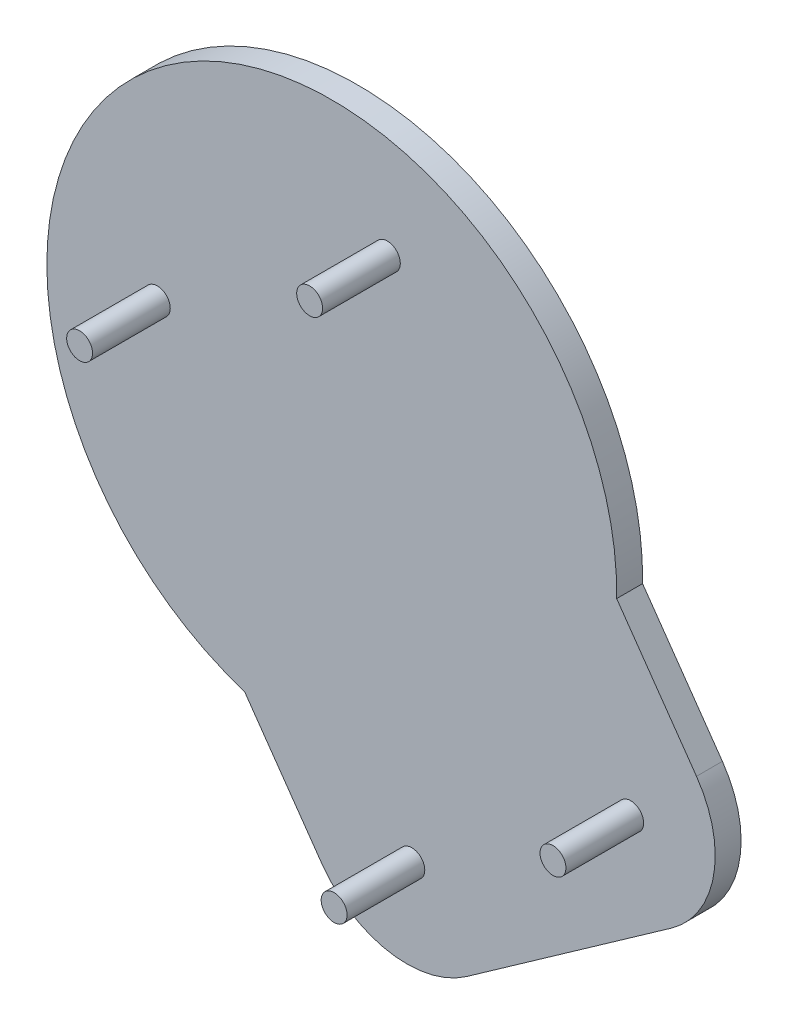
ISO-10303-21;
HEADER;
FILE_DESCRIPTION(('STEP AP214'),'2;1');
FILE_NAME('part.step','',(''),(''),'','','');
FILE_SCHEMA(('AUTOMOTIVE_DESIGN { 1 0 10303 214 1 1 1 1 }'));
ENDSEC;
DATA;
#1=APPLICATION_CONTEXT('core data for automotive mechanical design processes');
#2=APPLICATION_PROTOCOL_DEFINITION('international standard','automotive_design',2000,#1);
#3=PRODUCT_CONTEXT('',#1,'mechanical');
#4=PRODUCT('Part','Part','',(#3));
#5=PRODUCT_RELATED_PRODUCT_CATEGORY('part','',(#4));
#6=PRODUCT_DEFINITION_FORMATION('','',#4);
#7=PRODUCT_DEFINITION_CONTEXT('part definition',#1,'design');
#8=PRODUCT_DEFINITION('design','',#6,#7);
#9=PRODUCT_DEFINITION_SHAPE('','',#8);
#10=(LENGTH_UNIT() NAMED_UNIT(*) SI_UNIT(.MILLI.,.METRE.));
#11=(NAMED_UNIT(*) PLANE_ANGLE_UNIT() SI_UNIT($,.RADIAN.));
#12=(NAMED_UNIT(*) SI_UNIT($,.STERADIAN.) SOLID_ANGLE_UNIT());
#13=UNCERTAINTY_MEASURE_WITH_UNIT(LENGTH_MEASURE(1.E-05),#10,'distance_accuracy_value','');
#14=(GEOMETRIC_REPRESENTATION_CONTEXT(3) GLOBAL_UNCERTAINTY_ASSIGNED_CONTEXT((#13)) GLOBAL_UNIT_ASSIGNED_CONTEXT((#10,
#11,#12)) REPRESENTATION_CONTEXT('',''));
#15=CARTESIAN_POINT('',(0.,0.,0.));
#16=DIRECTION('',(0.,0.,1.));
#17=DIRECTION('',(1.,0.,0.));
#18=AXIS2_PLACEMENT_3D('',#15,#16,#17);
#19=CARTESIAN_POINT('',(-74.5185209199185,51.7749971600267,20.));
#20=DIRECTION('',(0.,0.,-1.));
#21=DIRECTION('',(-1.,0.,0.));
#22=AXIS2_PLACEMENT_3D('',#19,#20,#21);
#23=CYLINDRICAL_SURFACE('',#22,2.50000000000001);
#24=CARTESIAN_POINT('',(-74.5185209199185,51.7749971600267,20.));
#25=DIRECTION('',(0.,0.,1.));
#26=DIRECTION('',(1.,0.,0.));
#27=AXIS2_PLACEMENT_3D('',#24,#25,#26);
#28=CIRCLE('',#27,2.50000000000001);
#29=CARTESIAN_POINT('',(-72.0185209199185,51.7749971600267,20.));
#30=VERTEX_POINT('',#29);
#31=EDGE_CURVE('E55',#30,#30,#28,.T.);
#32=ORIENTED_EDGE('',*,*,#31,.F.);
#33=EDGE_LOOP('',(#32));
#34=FACE_BOUND('',#33,.T.);
#35=CARTESIAN_POINT('',(-74.5185209199185,51.7749971600267,5.));
#36=DIRECTION('',(0.,0.,1.));
#37=DIRECTION('',(1.,0.,0.));
#38=AXIS2_PLACEMENT_3D('',#35,#36,#37);
#39=CIRCLE('',#38,2.50000000000001);
#40=CARTESIAN_POINT('',(-72.0185209199185,51.7749971600267,5.));
#41=VERTEX_POINT('',#40);
#42=EDGE_CURVE('E11',#41,#41,#39,.T.);
#43=ORIENTED_EDGE('',*,*,#42,.T.);
#44=EDGE_LOOP('',(#43));
#45=FACE_BOUND('',#44,.T.);
#46=ADVANCED_FACE('F51',(#34,#45),#23,.T.);
#47=CARTESIAN_POINT('',(-74.5185209199185,51.7749971600267,20.));
#48=DIRECTION('',(0.,0.,1.));
#49=DIRECTION('',(1.,0.,0.));
#50=AXIS2_PLACEMENT_3D('',#47,#48,#49);
#51=PLANE('',#50);
#52=ORIENTED_EDGE('',*,*,#31,.T.);
#53=EDGE_LOOP('',(#52));
#54=FACE_BOUND('',#53,.T.);
#55=ADVANCED_FACE('F53',(#54),#51,.T.);
#56=CARTESIAN_POINT('',(-74.5185209199185,51.7749971600267,5.));
#57=DIRECTION('',(0.,0.,1.));
#58=DIRECTION('',(1.,0.,0.));
#59=AXIS2_PLACEMENT_3D('',#56,#57,#58);
#60=PLANE('',#59);
#61=ORIENTED_EDGE('',*,*,#42,.F.);
#62=EDGE_LOOP('',(#61));
#63=FACE_BOUND('',#62,.T.);
#64=ADVANCED_FACE('F70',(#63),#60,.F.);
#65=CLOSED_SHELL('',(#46,#55,#64));
#66=MANIFOLD_SOLID_BREP('B2',#65);
#67=CARTESIAN_POINT('',(-30.1155396434484,81.4789435820046,20.));
#68=DIRECTION('',(0.,0.,-1.));
#69=DIRECTION('',(-1.,0.,0.));
#70=AXIS2_PLACEMENT_3D('',#67,#68,#69);
#71=CYLINDRICAL_SURFACE('',#70,2.50000000000001);
#72=CARTESIAN_POINT('',(-30.1155396434484,81.4789435820046,20.));
#73=DIRECTION('',(0.,0.,1.));
#74=DIRECTION('',(1.,0.,0.));
#75=AXIS2_PLACEMENT_3D('',#72,#73,#74);
#76=CIRCLE('',#75,2.50000000000001);
#77=CARTESIAN_POINT('',(-27.6155396434484,81.4789435820046,20.));
#78=VERTEX_POINT('',#77);
#79=EDGE_CURVE('E109',#78,#78,#76,.T.);
#80=ORIENTED_EDGE('',*,*,#79,.F.);
#81=EDGE_LOOP('',(#80));
#82=FACE_BOUND('',#81,.T.);
#83=CARTESIAN_POINT('',(-30.1155396434484,81.4789435820046,5.));
#84=DIRECTION('',(0.,0.,1.));
#85=DIRECTION('',(1.,0.,0.));
#86=AXIS2_PLACEMENT_3D('',#83,#84,#85);
#87=CIRCLE('',#86,2.50000000000001);
#88=CARTESIAN_POINT('',(-27.6155396434484,81.4789435820046,5.));
#89=VERTEX_POINT('',#88);
#90=EDGE_CURVE('E50',#89,#89,#87,.T.);
#91=ORIENTED_EDGE('',*,*,#90,.T.);
#92=EDGE_LOOP('',(#91));
#93=FACE_BOUND('',#92,.T.);
#94=ADVANCED_FACE('F105',(#82,#93),#71,.T.);
#95=CARTESIAN_POINT('',(-30.1155396434484,81.4789435820046,20.));
#96=DIRECTION('',(0.,0.,1.));
#97=DIRECTION('',(1.,0.,0.));
#98=AXIS2_PLACEMENT_3D('',#95,#96,#97);
#99=PLANE('',#98);
#100=ORIENTED_EDGE('',*,*,#79,.T.);
#101=EDGE_LOOP('',(#100));
#102=FACE_BOUND('',#101,.T.);
#103=ADVANCED_FACE('F107',(#102),#99,.T.);
#104=CARTESIAN_POINT('',(-30.1155396434484,81.4789435820046,5.));
#105=DIRECTION('',(0.,0.,1.));
#106=DIRECTION('',(1.,0.,0.));
#107=AXIS2_PLACEMENT_3D('',#104,#105,#106);
#108=PLANE('',#107);
#109=ORIENTED_EDGE('',*,*,#90,.F.);
#110=EDGE_LOOP('',(#109));
#111=FACE_BOUND('',#110,.T.);
#112=ADVANCED_FACE('F124',(#111),#108,.F.);
#113=CLOSED_SHELL('',(#94,#103,#112));
#114=MANIFOLD_SOLID_BREP('B6',#113);
#115=CARTESIAN_POINT('',(-25.3905391851779,-17.5834556476924,20.));
#116=DIRECTION('',(0.,0.,-1.));
#117=DIRECTION('',(-1.,0.,0.));
#118=AXIS2_PLACEMENT_3D('',#115,#116,#117);
#119=CYLINDRICAL_SURFACE('',#118,2.5);
#120=CARTESIAN_POINT('',(-25.3905391851779,-17.5834556476924,20.));
#121=DIRECTION('',(0.,0.,1.));
#122=DIRECTION('',(1.,0.,0.));
#123=AXIS2_PLACEMENT_3D('',#120,#121,#122);
#124=CIRCLE('',#123,2.5);
#125=CARTESIAN_POINT('',(-22.8905391851779,-17.5834556476924,20.));
#126=VERTEX_POINT('',#125);
#127=EDGE_CURVE('E163',#126,#126,#124,.T.);
#128=ORIENTED_EDGE('',*,*,#127,.F.);
#129=EDGE_LOOP('',(#128));
#130=FACE_BOUND('',#129,.T.);
#131=CARTESIAN_POINT('',(-25.3905391851779,-17.5834556476924,5.));
#132=DIRECTION('',(0.,0.,1.));
#133=DIRECTION('',(1.,0.,0.));
#134=AXIS2_PLACEMENT_3D('',#131,#132,#133);
#135=CIRCLE('',#134,2.5);
#136=CARTESIAN_POINT('',(-22.8905391851779,-17.5834556476924,5.));
#137=VERTEX_POINT('',#136);
#138=EDGE_CURVE('E104',#137,#137,#135,.T.);
#139=ORIENTED_EDGE('',*,*,#138,.T.);
#140=EDGE_LOOP('',(#139));
#141=FACE_BOUND('',#140,.T.);
#142=ADVANCED_FACE('F159',(#130,#141),#119,.T.);
#143=CARTESIAN_POINT('',(-25.3905391851779,-17.5834556476924,20.));
#144=DIRECTION('',(0.,0.,1.));
#145=DIRECTION('',(1.,0.,0.));
#146=AXIS2_PLACEMENT_3D('',#143,#144,#145);
#147=PLANE('',#146);
#148=ORIENTED_EDGE('',*,*,#127,.T.);
#149=EDGE_LOOP('',(#148));
#150=FACE_BOUND('',#149,.T.);
#151=ADVANCED_FACE('F161',(#150),#147,.T.);
#152=CARTESIAN_POINT('',(-25.3905391851779,-17.5834556476924,5.));
#153=DIRECTION('',(0.,0.,1.));
#154=DIRECTION('',(1.,0.,0.));
#155=AXIS2_PLACEMENT_3D('',#152,#153,#154);
#156=PLANE('',#155);
#157=ORIENTED_EDGE('',*,*,#138,.F.);
#158=EDGE_LOOP('',(#157));
#159=FACE_BOUND('',#158,.T.);
#160=ADVANCED_FACE('F178',(#159),#156,.F.);
#161=CLOSED_SHELL('',(#142,#151,#160));
#162=MANIFOLD_SOLID_BREP('B45',#161);
#163=CARTESIAN_POINT('',(16.857134213477,11.4036523546496,20.));
#164=DIRECTION('',(0.,0.,-1.));
#165=DIRECTION('',(-1.,0.,0.));
#166=AXIS2_PLACEMENT_3D('',#163,#164,#165);
#167=CYLINDRICAL_SURFACE('',#166,2.50000000000001);
#168=CARTESIAN_POINT('',(16.857134213477,11.4036523546496,20.));
#169=DIRECTION('',(0.,0.,1.));
#170=DIRECTION('',(1.,0.,0.));
#171=AXIS2_PLACEMENT_3D('',#168,#169,#170);
#172=CIRCLE('',#171,2.50000000000001);
#173=CARTESIAN_POINT('',(19.357134213477,11.4036523546496,20.));
#174=VERTEX_POINT('',#173);
#175=EDGE_CURVE('E158',#174,#174,#172,.T.);
#176=ORIENTED_EDGE('',*,*,#175,.F.);
#177=EDGE_LOOP('',(#176));
#178=FACE_BOUND('',#177,.T.);
#179=CARTESIAN_POINT('',(16.857134213477,11.4036523546496,5.));
#180=DIRECTION('',(0.,0.,1.));
#181=DIRECTION('',(1.,0.,0.));
#182=AXIS2_PLACEMENT_3D('',#179,#180,#181);
#183=CIRCLE('',#182,2.50000000000001);
#184=CARTESIAN_POINT('',(19.357134213477,11.4036523546496,5.));
#185=VERTEX_POINT('',#184);
#186=EDGE_CURVE('E217',#185,#185,#183,.T.);
#187=ORIENTED_EDGE('',*,*,#186,.T.);
#188=EDGE_LOOP('',(#187));
#189=FACE_BOUND('',#188,.T.);
#190=ADVANCED_FACE('F214',(#178,#189),#167,.T.);
#191=CARTESIAN_POINT('',(16.857134213477,11.4036523546496,20.));
#192=DIRECTION('',(0.,0.,1.));
#193=DIRECTION('',(1.,0.,0.));
#194=AXIS2_PLACEMENT_3D('',#191,#192,#193);
#195=PLANE('',#194);
#196=ORIENTED_EDGE('',*,*,#175,.T.);
#197=EDGE_LOOP('',(#196));
#198=FACE_BOUND('',#197,.T.);
#199=ADVANCED_FACE('F229',(#198),#195,.T.);
#200=CARTESIAN_POINT('',(16.857134213477,11.4036523546496,5.));
#201=DIRECTION('',(0.,0.,1.));
#202=DIRECTION('',(1.,0.,0.));
#203=AXIS2_PLACEMENT_3D('',#200,#201,#202);
#204=PLANE('',#203);
#205=ORIENTED_EDGE('',*,*,#186,.F.);
#206=EDGE_LOOP('',(#205));
#207=FACE_BOUND('',#206,.T.);
#208=ADVANCED_FACE('F227',(#207),#204,.F.);
#209=CLOSED_SHELL('',(#190,#199,#208));
#210=MANIFOLD_SOLID_BREP('B99',#209);
#211=CARTESIAN_POINT('',(-40.8400789490038,47.2312465569129,5.));
#212=DIRECTION('',(0.,0.,1.));
#213=DIRECTION('',(1.,0.,0.));
#214=AXIS2_PLACEMENT_3D('',#211,#212,#213);
#215=PLANE('',#214);
#216=CARTESIAN_POINT('',(-74.5185209199185,51.7749971600267,5.));
#217=DIRECTION('',(0.,0.,1.));
#218=DIRECTION('',(1.,0.,0.));
#219=AXIS2_PLACEMENT_3D('',#216,#217,#218);
#220=CIRCLE('',#219,2.50000000000002);
#221=CARTESIAN_POINT('',(-72.0185209199185,51.7749971600267,5.));
#222=VERTEX_POINT('',#221);
#223=EDGE_CURVE('E433',#222,#222,#220,.T.);
#224=ORIENTED_EDGE('',*,*,#223,.F.);
#225=EDGE_LOOP('',(#224));
#226=FACE_BOUND('',#225,.T.);
#227=CARTESIAN_POINT('',(16.857134213477,11.4036523546496,5.));
#228=DIRECTION('',(0.,0.,1.));
#229=DIRECTION('',(1.,0.,0.));
#230=AXIS2_PLACEMENT_3D('',#227,#228,#229);
#231=CIRCLE('',#230,2.50000000000001);
#232=CARTESIAN_POINT('',(19.357134213477,11.4036523546496,5.));
#233=VERTEX_POINT('',#232);
#234=EDGE_CURVE('E355',#233,#233,#231,.T.);
#235=ORIENTED_EDGE('',*,*,#234,.F.);
#236=EDGE_LOOP('',(#235));
#237=FACE_BOUND('',#236,.T.);
#238=CARTESIAN_POINT('',(-40.8400789490038,47.2312465569129,5.));
#239=DIRECTION('',(0.,0.,1.));
#240=DIRECTION('',(1.,0.,0.));
#241=AXIS2_PLACEMENT_3D('',#238,#239,#240);
#242=CIRCLE('',#241,55.);
#243=CARTESIAN_POINT('',(14.1526546191799,46.3372360990538,5.));
#244=VERTEX_POINT('',#243);
#245=CARTESIAN_POINT('',(-57.6728115875673,-5.12960820997038,5.));
#246=VERTEX_POINT('',#245);
#247=EDGE_CURVE('E367',#244,#246,#242,.T.);
#248=ORIENTED_EDGE('',*,*,#247,.T.);
#249=DIRECTION('',(0.57357643635105,-0.819152044288989,0.));
#250=VECTOR('',#249,1.);
#251=CARTESIAN_POINT('',(-57.6728115875673,-5.12960820997038,5.));
#252=LINE('',#251,#250);
#253=CARTESIAN_POINT('',(-42.7356817571262,-26.4620404037628,5.));
#254=VERTEX_POINT('',#253);
#255=EDGE_CURVE('E315',#246,#254,#252,.T.);
#256=ORIENTED_EDGE('',*,*,#255,.T.);
#257=CARTESIAN_POINT('',(-26.3526408713464,-14.9905116767419,5.));
#258=DIRECTION('',(0.,0.,1.));
#259=DIRECTION('',(1.,0.,0.));
#260=AXIS2_PLACEMENT_3D('',#257,#258,#259);
#261=CIRCLE('',#260,20.);
#262=CARTESIAN_POINT('',(-14.8326585328515,-31.339517974397,5.));
#263=VERTEX_POINT('',#262);
#264=EDGE_CURVE('E328',#254,#263,#261,.T.);
#265=ORIENTED_EDGE('',*,*,#264,.T.);
#266=DIRECTION('',(0.817450314882761,0.575999116924735,0.));
#267=VECTOR('',#266,1.);
#268=CARTESIAN_POINT('',(-14.8326585328515,-31.339517974397,5.));
#269=LINE('',#268,#267);
#270=CARTESIAN_POINT('',(24.6962619923903,-3.48629815051967,5.));
#271=VERTEX_POINT('',#270);
#272=EDGE_CURVE('E322',#263,#271,#269,.T.);
#273=ORIENTED_EDGE('',*,*,#272,.T.);
#274=CARTESIAN_POINT('',(13.1762796538957,12.8627081471356,5.));
#275=DIRECTION('',(0.,0.,1.));
#276=DIRECTION('',(1.,0.,0.));
#277=AXIS2_PLACEMENT_3D('',#274,#275,#276);
#278=CIRCLE('',#277,20.);
#279=CARTESIAN_POINT('',(29.5593205396754,24.3342368741567,5.));
#280=VERTEX_POINT('',#279);
#281=EDGE_CURVE('E326',#271,#280,#278,.T.);
#282=ORIENTED_EDGE('',*,*,#281,.T.);
#283=DIRECTION('',(-0.57357643635105,0.819152044288989,0.));
#284=VECTOR('',#283,1.);
#285=CARTESIAN_POINT('',(29.5593205396754,24.3342368741567,5.));
#286=LINE('',#285,#284);
#287=EDGE_CURVE('E278',#280,#244,#286,.T.);
#288=ORIENTED_EDGE('',*,*,#287,.T.);
#289=EDGE_LOOP('',(#248,#256,#265,#273,#282,#288));
#290=FACE_BOUND('',#289,.T.);
#291=CARTESIAN_POINT('',(-25.3905391851779,-17.5834556476924,5.));
#292=DIRECTION('',(0.,0.,1.));
#293=DIRECTION('',(1.,0.,0.));
#294=AXIS2_PLACEMENT_3D('',#291,#292,#293);
#295=CIRCLE('',#294,2.5);
#296=CARTESIAN_POINT('',(-22.8905391851779,-17.5834556476924,5.));
#297=VERTEX_POINT('',#296);
#298=EDGE_CURVE('E441',#297,#297,#295,.T.);
#299=ORIENTED_EDGE('',*,*,#298,.F.);
#300=EDGE_LOOP('',(#299));
#301=FACE_BOUND('',#300,.T.);
#302=CARTESIAN_POINT('',(-30.1155396434484,81.4789435820046,5.));
#303=DIRECTION('',(0.,0.,1.));
#304=DIRECTION('',(1.,0.,0.));
#305=AXIS2_PLACEMENT_3D('',#302,#303,#304);
#306=CIRCLE('',#305,2.50000000000001);
#307=CARTESIAN_POINT('',(-27.6155396434484,81.4789435820046,5.));
#308=VERTEX_POINT('',#307);
#309=EDGE_CURVE('E422',#308,#308,#306,.T.);
#310=ORIENTED_EDGE('',*,*,#309,.F.);
#311=EDGE_LOOP('',(#310));
#312=FACE_BOUND('',#311,.T.);
#313=ADVANCED_FACE('F260',(#226,#237,#290,#301,#312),#215,.T.);
#314=CARTESIAN_POINT('',(-40.8400789490038,47.2312465569129,0.));
#315=DIRECTION('',(0.,0.,1.));
#316=DIRECTION('',(1.,0.,0.));
#317=AXIS2_PLACEMENT_3D('',#314,#315,#316);
#318=PLANE('',#317);
#319=CARTESIAN_POINT('',(-40.8400789490038,47.2312465569129,0.));
#320=DIRECTION('',(0.,0.,1.));
#321=DIRECTION('',(1.,0.,0.));
#322=AXIS2_PLACEMENT_3D('',#319,#320,#321);
#323=CIRCLE('',#322,55.);
#324=CARTESIAN_POINT('',(14.1526546191799,46.3372360990538,0.));
#325=VERTEX_POINT('',#324);
#326=CARTESIAN_POINT('',(-57.6728115875673,-5.12960820997038,0.));
#327=VERTEX_POINT('',#326);
#328=EDGE_CURVE('E350',#325,#327,#323,.T.);
#329=ORIENTED_EDGE('',*,*,#328,.F.);
#330=DIRECTION('',(-0.57357643635105,0.819152044288989,0.));
#331=VECTOR('',#330,1.);
#332=CARTESIAN_POINT('',(29.5593205396754,24.3342368741567,0.));
#333=LINE('',#332,#331);
#334=CARTESIAN_POINT('',(29.5593205396754,24.3342368741567,0.));
#335=VERTEX_POINT('',#334);
#336=EDGE_CURVE('E307',#335,#325,#333,.T.);
#337=ORIENTED_EDGE('',*,*,#336,.F.);
#338=CARTESIAN_POINT('',(13.1762796538957,12.8627081471356,0.));
#339=DIRECTION('',(0.,0.,1.));
#340=DIRECTION('',(1.,0.,0.));
#341=AXIS2_PLACEMENT_3D('',#338,#339,#340);
#342=CIRCLE('',#341,20.);
#343=CARTESIAN_POINT('',(24.6962619923903,-3.48629815051967,0.));
#344=VERTEX_POINT('',#343);
#345=EDGE_CURVE('E301',#344,#335,#342,.T.);
#346=ORIENTED_EDGE('',*,*,#345,.F.);
#347=DIRECTION('',(0.817450314882761,0.575999116924735,0.));
#348=VECTOR('',#347,1.);
#349=CARTESIAN_POINT('',(-14.8326585328515,-31.339517974397,0.));
#350=LINE('',#349,#348);
#351=CARTESIAN_POINT('',(-14.8326585328515,-31.339517974397,0.));
#352=VERTEX_POINT('',#351);
#353=EDGE_CURVE('E337',#352,#344,#350,.T.);
#354=ORIENTED_EDGE('',*,*,#353,.F.);
#355=CARTESIAN_POINT('',(-26.3526408713464,-14.9905116767419,0.));
#356=DIRECTION('',(0.,0.,1.));
#357=DIRECTION('',(1.,0.,0.));
#358=AXIS2_PLACEMENT_3D('',#355,#356,#357);
#359=CIRCLE('',#358,20.);
#360=CARTESIAN_POINT('',(-42.7356817571262,-26.4620404037628,0.));
#361=VERTEX_POINT('',#360);
#362=EDGE_CURVE('E358',#361,#352,#359,.T.);
#363=ORIENTED_EDGE('',*,*,#362,.F.);
#364=DIRECTION('',(0.57357643635105,-0.819152044288989,0.));
#365=VECTOR('',#364,1.);
#366=CARTESIAN_POINT('',(-57.6728115875673,-5.12960820997038,0.));
#367=LINE('',#366,#365);
#368=EDGE_CURVE('E354',#327,#361,#367,.T.);
#369=ORIENTED_EDGE('',*,*,#368,.F.);
#370=EDGE_LOOP('',(#329,#337,#346,#354,#363,#369));
#371=FACE_BOUND('',#370,.T.);
#372=CARTESIAN_POINT('',(16.857134213477,11.4036523546496,0.));
#373=DIRECTION('',(0.,0.,1.));
#374=DIRECTION('',(1.,0.,0.));
#375=AXIS2_PLACEMENT_3D('',#372,#373,#374);
#376=CIRCLE('',#375,2.50000000000001);
#377=CARTESIAN_POINT('',(19.357134213477,11.4036523546496,0.));
#378=VERTEX_POINT('',#377);
#379=EDGE_CURVE('E445',#378,#378,#376,.T.);
#380=ORIENTED_EDGE('',*,*,#379,.T.);
#381=EDGE_LOOP('',(#380));
#382=FACE_BOUND('',#381,.T.);
#383=CARTESIAN_POINT('',(-25.3905391851779,-17.5834556476924,0.));
#384=DIRECTION('',(0.,0.,1.));
#385=DIRECTION('',(1.,0.,0.));
#386=AXIS2_PLACEMENT_3D('',#383,#384,#385);
#387=CIRCLE('',#386,2.5);
#388=CARTESIAN_POINT('',(-22.8905391851779,-17.5834556476924,0.));
#389=VERTEX_POINT('',#388);
#390=EDGE_CURVE('E437',#389,#389,#387,.T.);
#391=ORIENTED_EDGE('',*,*,#390,.T.);
#392=EDGE_LOOP('',(#391));
#393=FACE_BOUND('',#392,.T.);
#394=CARTESIAN_POINT('',(-74.5185209199185,51.7749971600267,0.));
#395=DIRECTION('',(0.,0.,1.));
#396=DIRECTION('',(1.,0.,0.));
#397=AXIS2_PLACEMENT_3D('',#394,#395,#396);
#398=CIRCLE('',#397,2.50000000000002);
#399=CARTESIAN_POINT('',(-72.0185209199185,51.7749971600267,0.));
#400=VERTEX_POINT('',#399);
#401=EDGE_CURVE('E430',#400,#400,#398,.T.);
#402=ORIENTED_EDGE('',*,*,#401,.T.);
#403=EDGE_LOOP('',(#402));
#404=FACE_BOUND('',#403,.T.);
#405=CARTESIAN_POINT('',(-30.1155396434484,81.4789435820046,0.));
#406=DIRECTION('',(0.,0.,1.));
#407=DIRECTION('',(1.,0.,0.));
#408=AXIS2_PLACEMENT_3D('',#405,#406,#407);
#409=CIRCLE('',#408,2.50000000000001);
#410=CARTESIAN_POINT('',(-27.6155396434484,81.4789435820046,0.));
#411=VERTEX_POINT('',#410);
#412=EDGE_CURVE('E425',#411,#411,#409,.T.);
#413=ORIENTED_EDGE('',*,*,#412,.T.);
#414=EDGE_LOOP('',(#413));
#415=FACE_BOUND('',#414,.T.);
#416=ADVANCED_FACE('F380',(#371,#382,#393,#404,#415),#318,.F.);
#417=CARTESIAN_POINT('',(-40.8400789490038,47.2312465569129,5.));
#418=DIRECTION('',(0.,0.,-1.));
#419=DIRECTION('',(-1.,0.,0.));
#420=AXIS2_PLACEMENT_3D('',#417,#418,#419);
#421=CYLINDRICAL_SURFACE('',#420,55.);
#422=ORIENTED_EDGE('',*,*,#328,.T.);
#423=DIRECTION('',(0.,0.,-1.));
#424=VECTOR('',#423,1.);
#425=CARTESIAN_POINT('',(-57.6728115875673,-5.12960820997038,5.));
#426=LINE('',#425,#424);
#427=EDGE_CURVE('E212',#246,#327,#426,.T.);
#428=ORIENTED_EDGE('',*,*,#427,.F.);
#429=ORIENTED_EDGE('',*,*,#247,.F.);
#430=DIRECTION('',(0.,0.,-1.));
#431=VECTOR('',#430,1.);
#432=CARTESIAN_POINT('',(14.1526546191799,46.3372360990538,5.));
#433=LINE('',#432,#431);
#434=EDGE_CURVE('E346',#244,#325,#433,.T.);
#435=ORIENTED_EDGE('',*,*,#434,.T.);
#436=EDGE_LOOP('',(#422,#428,#429,#435));
#437=FACE_BOUND('',#436,.T.);
#438=ADVANCED_FACE('F262',(#437),#421,.T.);
#439=CARTESIAN_POINT('',(-57.6728115875673,-5.12960820997038,5.));
#440=DIRECTION('',(0.819152044288989,0.57357643635105,0.));
#441=DIRECTION('',(-0.57357643635105,0.819152044288989,0.));
#442=AXIS2_PLACEMENT_3D('',#439,#440,#441);
#443=PLANE('',#442);
#444=ORIENTED_EDGE('',*,*,#368,.T.);
#445=DIRECTION('',(0.,0.,-1.));
#446=VECTOR('',#445,1.);
#447=CARTESIAN_POINT('',(-42.7356817571262,-26.4620404037628,5.));
#448=LINE('',#447,#446);
#449=EDGE_CURVE('E270',#254,#361,#448,.T.);
#450=ORIENTED_EDGE('',*,*,#449,.F.);
#451=ORIENTED_EDGE('',*,*,#255,.F.);
#452=ORIENTED_EDGE('',*,*,#427,.T.);
#453=EDGE_LOOP('',(#444,#450,#451,#452));
#454=FACE_BOUND('',#453,.T.);
#455=ADVANCED_FACE('F513',(#454),#443,.F.);
#456=CARTESIAN_POINT('',(-26.3526408713464,-14.9905116767419,5.));
#457=DIRECTION('',(0.,0.,-1.));
#458=DIRECTION('',(-1.,0.,0.));
#459=AXIS2_PLACEMENT_3D('',#456,#457,#458);
#460=CYLINDRICAL_SURFACE('',#459,20.);
#461=ORIENTED_EDGE('',*,*,#362,.T.);
#462=DIRECTION('',(0.,0.,-1.));
#463=VECTOR('',#462,1.);
#464=CARTESIAN_POINT('',(-14.8326585328515,-31.339517974397,5.));
#465=LINE('',#464,#463);
#466=EDGE_CURVE('E339',#263,#352,#465,.T.);
#467=ORIENTED_EDGE('',*,*,#466,.F.);
#468=ORIENTED_EDGE('',*,*,#264,.F.);
#469=ORIENTED_EDGE('',*,*,#449,.T.);
#470=EDGE_LOOP('',(#461,#467,#468,#469));
#471=FACE_BOUND('',#470,.T.);
#472=ADVANCED_FACE('F377',(#471),#460,.T.);
#473=CARTESIAN_POINT('',(-14.8326585328515,-31.339517974397,5.));
#474=DIRECTION('',(-0.575999116924735,0.817450314882761,0.));
#475=DIRECTION('',(-0.817450314882761,-0.575999116924735,0.));
#476=AXIS2_PLACEMENT_3D('',#473,#474,#475);
#477=PLANE('',#476);
#478=ORIENTED_EDGE('',*,*,#353,.T.);
#479=DIRECTION('',(0.,0.,-1.));
#480=VECTOR('',#479,1.);
#481=CARTESIAN_POINT('',(24.6962619923903,-3.48629815051967,5.));
#482=LINE('',#481,#480);
#483=EDGE_CURVE('E334',#271,#344,#482,.T.);
#484=ORIENTED_EDGE('',*,*,#483,.F.);
#485=ORIENTED_EDGE('',*,*,#272,.F.);
#486=ORIENTED_EDGE('',*,*,#466,.T.);
#487=EDGE_LOOP('',(#478,#484,#485,#486));
#488=FACE_BOUND('',#487,.T.);
#489=ADVANCED_FACE('F335',(#488),#477,.F.);
#490=CARTESIAN_POINT('',(13.1762796538957,12.8627081471356,5.));
#491=DIRECTION('',(0.,0.,-1.));
#492=DIRECTION('',(-1.,0.,0.));
#493=AXIS2_PLACEMENT_3D('',#490,#491,#492);
#494=CYLINDRICAL_SURFACE('',#493,20.);
#495=ORIENTED_EDGE('',*,*,#345,.T.);
#496=DIRECTION('',(0.,0.,-1.));
#497=VECTOR('',#496,1.);
#498=CARTESIAN_POINT('',(29.5593205396754,24.3342368741567,5.));
#499=LINE('',#498,#497);
#500=EDGE_CURVE('E340',#280,#335,#499,.T.);
#501=ORIENTED_EDGE('',*,*,#500,.F.);
#502=ORIENTED_EDGE('',*,*,#281,.F.);
#503=ORIENTED_EDGE('',*,*,#483,.T.);
#504=EDGE_LOOP('',(#495,#501,#502,#503));
#505=FACE_BOUND('',#504,.T.);
#506=ADVANCED_FACE('F342',(#505),#494,.T.);
#507=CARTESIAN_POINT('',(29.5593205396754,24.3342368741567,5.));
#508=DIRECTION('',(-0.819152044288989,-0.57357643635105,0.));
#509=DIRECTION('',(0.57357643635105,-0.819152044288989,0.));
#510=AXIS2_PLACEMENT_3D('',#507,#508,#509);
#511=PLANE('',#510);
#512=ORIENTED_EDGE('',*,*,#336,.T.);
#513=ORIENTED_EDGE('',*,*,#434,.F.);
#514=ORIENTED_EDGE('',*,*,#287,.F.);
#515=ORIENTED_EDGE('',*,*,#500,.T.);
#516=EDGE_LOOP('',(#512,#513,#514,#515));
#517=FACE_BOUND('',#516,.T.);
#518=ADVANCED_FACE('F385',(#517),#511,.F.);
#519=CARTESIAN_POINT('',(16.857134213477,11.4036523546496,5.));
#520=DIRECTION('',(0.,0.,-1.));
#521=DIRECTION('',(-1.,0.,0.));
#522=AXIS2_PLACEMENT_3D('',#519,#520,#521);
#523=CYLINDRICAL_SURFACE('',#522,2.50000000000001);
#524=ORIENTED_EDGE('',*,*,#234,.T.);
#525=EDGE_LOOP('',(#524));
#526=FACE_BOUND('',#525,.T.);
#527=ORIENTED_EDGE('',*,*,#379,.F.);
#528=EDGE_LOOP('',(#527));
#529=FACE_BOUND('',#528,.T.);
#530=ADVANCED_FACE('F387',(#526,#529),#523,.F.);
#531=CARTESIAN_POINT('',(-25.3905391851779,-17.5834556476924,5.));
#532=DIRECTION('',(0.,0.,-1.));
#533=DIRECTION('',(-1.,0.,0.));
#534=AXIS2_PLACEMENT_3D('',#531,#532,#533);
#535=CYLINDRICAL_SURFACE('',#534,2.5);
#536=ORIENTED_EDGE('',*,*,#298,.T.);
#537=EDGE_LOOP('',(#536));
#538=FACE_BOUND('',#537,.T.);
#539=ORIENTED_EDGE('',*,*,#390,.F.);
#540=EDGE_LOOP('',(#539));
#541=FACE_BOUND('',#540,.T.);
#542=ADVANCED_FACE('F393',(#538,#541),#535,.F.);
#543=CARTESIAN_POINT('',(-74.5185209199185,51.7749971600267,5.));
#544=DIRECTION('',(0.,0.,-1.));
#545=DIRECTION('',(-1.,0.,0.));
#546=AXIS2_PLACEMENT_3D('',#543,#544,#545);
#547=CYLINDRICAL_SURFACE('',#546,2.50000000000002);
#548=ORIENTED_EDGE('',*,*,#223,.T.);
#549=EDGE_LOOP('',(#548));
#550=FACE_BOUND('',#549,.T.);
#551=ORIENTED_EDGE('',*,*,#401,.F.);
#552=EDGE_LOOP('',(#551));
#553=FACE_BOUND('',#552,.T.);
#554=ADVANCED_FACE('F409',(#550,#553),#547,.F.);
#555=CARTESIAN_POINT('',(-30.1155396434484,81.4789435820046,5.));
#556=DIRECTION('',(0.,0.,-1.));
#557=DIRECTION('',(-1.,0.,0.));
#558=AXIS2_PLACEMENT_3D('',#555,#556,#557);
#559=CYLINDRICAL_SURFACE('',#558,2.50000000000001);
#560=ORIENTED_EDGE('',*,*,#309,.T.);
#561=EDGE_LOOP('',(#560));
#562=FACE_BOUND('',#561,.T.);
#563=ORIENTED_EDGE('',*,*,#412,.F.);
#564=EDGE_LOOP('',(#563));
#565=FACE_BOUND('',#564,.T.);
#566=ADVANCED_FACE('F413',(#562,#565),#559,.F.);
#567=CLOSED_SHELL('',(#313,#416,#438,#455,#472,#489,#506,#518,#530,#542,#554,#566));
#568=MANIFOLD_SOLID_BREP('B153',#567);
#569=ADVANCED_BREP_SHAPE_REPRESENTATION('',(#18,#66,#114,#162,#210,#568),#14);
#570=SHAPE_DEFINITION_REPRESENTATION(#9,#569);
ENDSEC;
END-ISO-10303-21;
